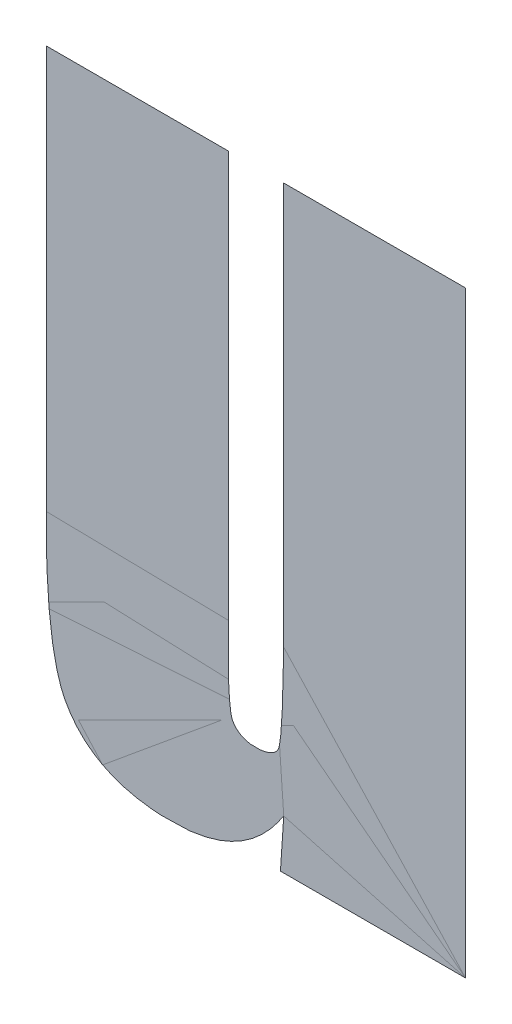
ISO-10303-21;
HEADER;
FILE_DESCRIPTION(('STEP AP214'),'2;1');
FILE_NAME('part.step','',(''),(''),'','','');
FILE_SCHEMA(('AUTOMOTIVE_DESIGN { 1 0 10303 214 1 1 1 1 }'));
ENDSEC;
DATA;
#1=APPLICATION_CONTEXT('core data for automotive mechanical design processes');
#2=APPLICATION_PROTOCOL_DEFINITION('international standard','automotive_design',2000,#1);
#3=PRODUCT_CONTEXT('',#1,'mechanical');
#4=PRODUCT('Part','Part','',(#3));
#5=PRODUCT_RELATED_PRODUCT_CATEGORY('part','',(#4));
#6=PRODUCT_DEFINITION_FORMATION('','',#4);
#7=PRODUCT_DEFINITION_CONTEXT('part definition',#1,'design');
#8=PRODUCT_DEFINITION('design','',#6,#7);
#9=PRODUCT_DEFINITION_SHAPE('','',#8);
#10=(LENGTH_UNIT() NAMED_UNIT(*) SI_UNIT(.MILLI.,.METRE.));
#11=(NAMED_UNIT(*) PLANE_ANGLE_UNIT() SI_UNIT($,.RADIAN.));
#12=(NAMED_UNIT(*) SI_UNIT($,.STERADIAN.) SOLID_ANGLE_UNIT());
#13=UNCERTAINTY_MEASURE_WITH_UNIT(LENGTH_MEASURE(1.E-05),#10,'distance_accuracy_value','');
#14=(GEOMETRIC_REPRESENTATION_CONTEXT(3) GLOBAL_UNCERTAINTY_ASSIGNED_CONTEXT((#13)) GLOBAL_UNIT_ASSIGNED_CONTEXT((#10,
#11,#12)) REPRESENTATION_CONTEXT('',''));
#15=CARTESIAN_POINT('',(0.,0.,0.));
#16=DIRECTION('',(0.,0.,1.));
#17=DIRECTION('',(1.,0.,0.));
#18=AXIS2_PLACEMENT_3D('',#15,#16,#17);
#19=CARTESIAN_POINT('',(6.704139413395,0.787181888775,0.001332));
#20=DIRECTION('',(0.,0.,1.));
#21=DIRECTION('',(1.,0.,0.));
#22=AXIS2_PLACEMENT_3D('',#19,#20,#21);
#23=PLANE('',#22);
#24=CARTESIAN_POINT('',(6.709096994908,0.689856296154,0.001668));
#25=DIRECTION('',(1.,0.,0.));
#26=VECTOR('',#25,1.);
#27=LINE('',#24,#26);
#28=CARTESIAN_POINT('',(6.709096994908,0.689856296154,0.0015));
#29=VERTEX_POINT('',#28);
#30=CARTESIAN_POINT('',(6.76598320525,0.689856296154,0.0015));
#31=VERTEX_POINT('',#30);
#32=EDGE_CURVE('E11',#29,#31,#27,.T.);
#33=ORIENTED_EDGE('',*,*,#32,.F.);
#34=CARTESIAN_POINT('',(6.710109805774,0.705048459153,0.001668));
#35=DIRECTION('',(-0.0665190104845485,-0.997785157859224,0.));
#36=VECTOR('',#35,1.);
#37=LINE('',#34,#36);
#38=CARTESIAN_POINT('',(6.710109805774,0.705048459153,0.0015));
#39=VERTEX_POINT('',#38);
#40=EDGE_CURVE('E28',#39,#29,#37,.T.);
#41=ORIENTED_EDGE('',*,*,#40,.F.);
#42=CARTESIAN_POINT('',(6.676180641742,0.686480259932,0.001668));
#43=CARTESIAN_POINT('',(6.69848922309954,0.686720598244752,0.001668));
#44=CARTESIAN_POINT('',(6.710109805774,0.705048459153,0.001668));
#45=B_SPLINE_CURVE_WITH_KNOTS('',2,(#42,#43,#44),.UNSPECIFIED.,.F.,.F.,(3,3),(0.,1.),.UNSPECIFIED.);
#46=CARTESIAN_POINT('',(6.676180641742,0.686480259932,0.0015));
#47=VERTEX_POINT('',#46);
#48=EDGE_CURVE('E189',#47,#39,#45,.T.);
#49=ORIENTED_EDGE('',*,*,#48,.F.);
#50=CARTESIAN_POINT('',(6.637187423376,0.749612137285,0.001668));
#51=CARTESIAN_POINT('',(6.637187423376,0.713678355698294,0.001668));
#52=CARTESIAN_POINT('',(6.64301108586,0.702600832892,0.001668));
#53=CARTESIAN_POINT('',(6.65148597484099,0.686480259932,0.001668));
#54=CARTESIAN_POINT('',(6.676180641742,0.686480259932,0.001668));
#55=B_SPLINE_CURVE_WITH_KNOTS('',2,(#50,#51,#52,#53,#54),.UNSPECIFIED.,.F.,.F.,(3,2,3),(0.,0.5,
1.),.UNSPECIFIED.);
#56=CARTESIAN_POINT('',(6.637187423376,0.749612137285,0.0015));
#57=VERTEX_POINT('',#56);
#58=EDGE_CURVE('E187',#57,#47,#55,.T.);
#59=ORIENTED_EDGE('',*,*,#58,.F.);
#60=CARTESIAN_POINT('',(6.637187423376,0.873512666637,0.001668));
#61=DIRECTION('',(0.,-1.,0.));
#62=VECTOR('',#61,1.);
#63=LINE('',#60,#62);
#64=CARTESIAN_POINT('',(6.637187423376,0.873512666637,0.0015));
#65=VERTEX_POINT('',#64);
#66=EDGE_CURVE('E185',#65,#57,#63,.T.);
#67=ORIENTED_EDGE('',*,*,#66,.F.);
#68=CARTESIAN_POINT('',(6.693060822853,0.873512666637,0.001668));
#69=DIRECTION('',(-1.,0.,0.));
#70=VECTOR('',#69,1.);
#71=LINE('',#68,#70);
#72=CARTESIAN_POINT('',(6.693060822853,0.873512666637,0.0015));
#73=VERTEX_POINT('',#72);
#74=EDGE_CURVE('E183',#73,#65,#71,.T.);
#75=ORIENTED_EDGE('',*,*,#74,.F.);
#76=CARTESIAN_POINT('',(6.693060822853,0.748599326419,0.001668));
#77=DIRECTION('',(0.,1.,0.));
#78=VECTOR('',#77,1.);
#79=LINE('',#76,#78);
#80=CARTESIAN_POINT('',(6.693060822853,0.748599326419,0.0015));
#81=VERTEX_POINT('',#80);
#82=EDGE_CURVE('E181',#81,#73,#79,.T.);
#83=ORIENTED_EDGE('',*,*,#82,.F.);
#84=CARTESIAN_POINT('',(6.701500913408,0.719059009475,0.001668));
#85=CARTESIAN_POINT('',(6.69609388755468,0.719365688605414,0.001668));
#86=CARTESIAN_POINT('',(6.6944112373415,0.7231102529415,0.001668));
#87=CARTESIAN_POINT('',(6.693060822853,0.72611546097165,0.001668));
#88=CARTESIAN_POINT('',(6.693060822853,0.748599326419,0.001668));
#89=B_SPLINE_CURVE_WITH_KNOTS('',2,(#84,#85,#86,#87,#88),.UNSPECIFIED.,.F.,.F.,(3,2,3),(0.,0.5,
1.),.UNSPECIFIED.);
#90=CARTESIAN_POINT('',(6.701500913408,0.719059009475,0.0015));
#91=VERTEX_POINT('',#90);
#92=EDGE_CURVE('E179',#91,#81,#89,.T.);
#93=ORIENTED_EDGE('',*,*,#92,.F.);
#94=CARTESIAN_POINT('',(6.710109805774,0.749949740908,0.001668));
#95=CARTESIAN_POINT('',(6.710109805774,0.729182826414973,0.001668));
#96=CARTESIAN_POINT('',(6.7089281930965,0.723194653847,0.001668));
#97=CARTESIAN_POINT('',(6.70818253919879,0.719415831648759,0.001668));
#98=CARTESIAN_POINT('',(6.701500913408,0.719059009475,0.001668));
#99=B_SPLINE_CURVE_WITH_KNOTS('',2,(#94,#95,#96,#97,#98),.UNSPECIFIED.,.F.,.F.,(3,2,3),(0.,0.5,
1.),.UNSPECIFIED.);
#100=CARTESIAN_POINT('',(6.710109805774,0.749949740908,0.0015));
#101=VERTEX_POINT('',#100);
#102=EDGE_CURVE('E178',#101,#91,#99,.T.);
#103=ORIENTED_EDGE('',*,*,#102,.F.);
#104=CARTESIAN_POINT('',(6.710109805774,0.873512666637,0.001668));
#105=DIRECTION('',(0.,-1.,0.));
#106=VECTOR('',#105,1.);
#107=LINE('',#104,#106);
#108=CARTESIAN_POINT('',(6.710109805774,0.873512666637,0.0015));
#109=VERTEX_POINT('',#108);
#110=EDGE_CURVE('E176',#109,#101,#107,.T.);
#111=ORIENTED_EDGE('',*,*,#110,.F.);
#112=CARTESIAN_POINT('',(6.76598320525,0.873512666637,0.001668));
#113=DIRECTION('',(-1.,0.,0.));
#114=VECTOR('',#113,1.);
#115=LINE('',#112,#114);
#116=CARTESIAN_POINT('',(6.76598320525,0.873512666637,0.0015));
#117=VERTEX_POINT('',#116);
#118=EDGE_CURVE('E65',#117,#109,#115,.T.);
#119=ORIENTED_EDGE('',*,*,#118,.F.);
#120=CARTESIAN_POINT('',(6.76598320525,0.689856296154,0.001668));
#121=DIRECTION('',(0.,1.,0.));
#122=VECTOR('',#121,1.);
#123=LINE('',#120,#122);
#124=EDGE_CURVE('E68',#31,#117,#123,.T.);
#125=ORIENTED_EDGE('',*,*,#124,.F.);
#126=EDGE_LOOP('',(#33,#41,#49,#59,#67,#75,#83,#93,#103,#111,#119,#125));
#127=FACE_BOUND('',#126,.T.);
#128=ADVANCED_FACE('F17',(#127),#23,.F.);
#129=CARTESIAN_POINT('',(6.704139413395,0.787181888775,0.001668));
#130=DIRECTION('',(0.,0.,1.));
#131=DIRECTION('',(1.,0.,0.));
#132=AXIS2_PLACEMENT_3D('',#129,#130,#131);
#133=PLANE('',#132);
#134=ORIENTED_EDGE('',*,*,#40,.T.);
#135=ORIENTED_EDGE('',*,*,#32,.T.);
#136=ORIENTED_EDGE('',*,*,#124,.T.);
#137=ORIENTED_EDGE('',*,*,#118,.T.);
#138=ORIENTED_EDGE('',*,*,#110,.T.);
#139=ORIENTED_EDGE('',*,*,#102,.T.);
#140=ORIENTED_EDGE('',*,*,#92,.T.);
#141=ORIENTED_EDGE('',*,*,#82,.T.);
#142=ORIENTED_EDGE('',*,*,#74,.T.);
#143=ORIENTED_EDGE('',*,*,#66,.T.);
#144=ORIENTED_EDGE('',*,*,#58,.T.);
#145=ORIENTED_EDGE('',*,*,#48,.T.);
#146=EDGE_LOOP('',(#134,#135,#136,#137,#138,#139,#140,#141,#142,#143,#144,#145));
#147=FACE_BOUND('',#146,.T.);
#148=ADVANCED_FACE('F73',(#147),#133,.T.);
#149=CLOSED_SHELL('',(#128,#148));
#150=MANIFOLD_SOLID_BREP('B1',#149);
#151=ADVANCED_BREP_SHAPE_REPRESENTATION('',(#18,#150),#14);
#152=SHAPE_DEFINITION_REPRESENTATION(#9,#151);
ENDSEC;
END-ISO-10303-21;
